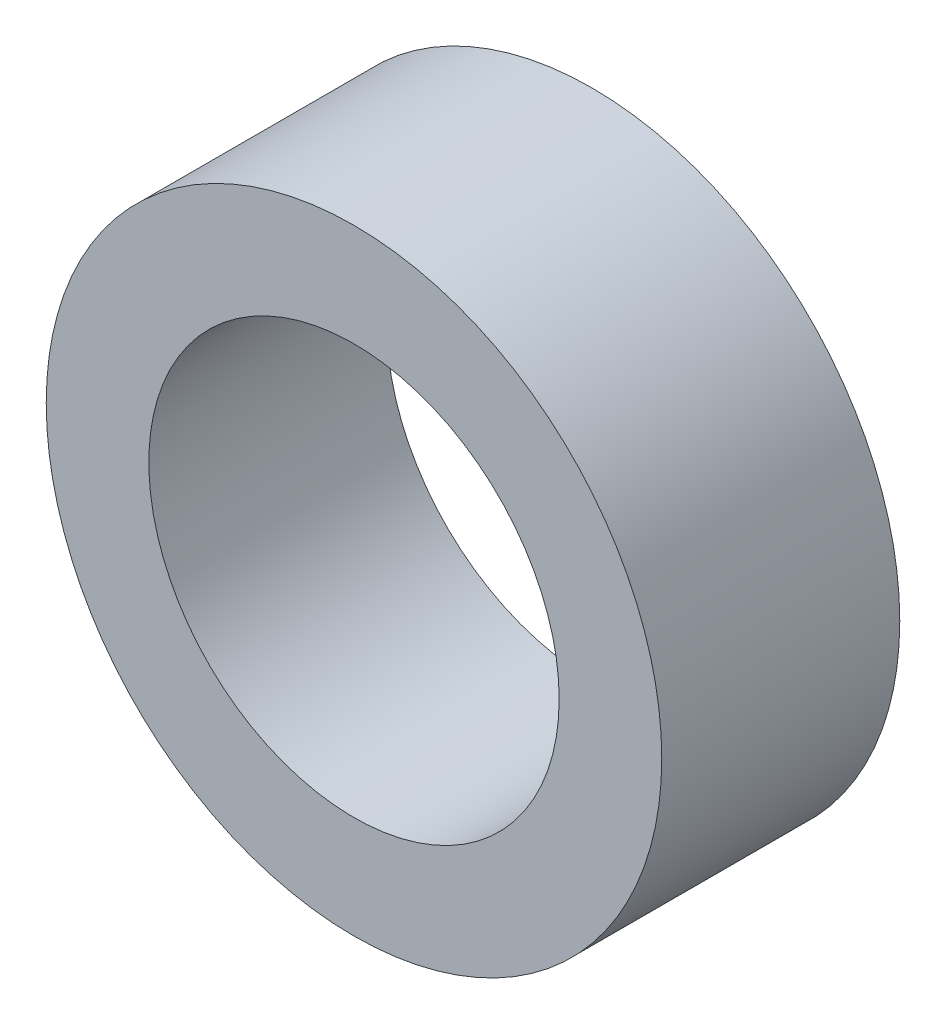
ISO-10303-21;
HEADER;
FILE_DESCRIPTION(('STEP AP214'),'2;1');
FILE_NAME('part.step','',(''),(''),'','','');
FILE_SCHEMA(('AUTOMOTIVE_DESIGN { 1 0 10303 214 1 1 1 1 }'));
ENDSEC;
DATA;
#1=APPLICATION_CONTEXT('core data for automotive mechanical design processes');
#2=APPLICATION_PROTOCOL_DEFINITION('international standard','automotive_design',2000,#1);
#3=PRODUCT_CONTEXT('',#1,'mechanical');
#4=PRODUCT('Part','Part','',(#3));
#5=PRODUCT_RELATED_PRODUCT_CATEGORY('part','',(#4));
#6=PRODUCT_DEFINITION_FORMATION('','',#4);
#7=PRODUCT_DEFINITION_CONTEXT('part definition',#1,'design');
#8=PRODUCT_DEFINITION('design','',#6,#7);
#9=PRODUCT_DEFINITION_SHAPE('','',#8);
#10=(LENGTH_UNIT() NAMED_UNIT(*) SI_UNIT(.MILLI.,.METRE.));
#11=(NAMED_UNIT(*) PLANE_ANGLE_UNIT() SI_UNIT($,.RADIAN.));
#12=(NAMED_UNIT(*) SI_UNIT($,.STERADIAN.) SOLID_ANGLE_UNIT());
#13=UNCERTAINTY_MEASURE_WITH_UNIT(LENGTH_MEASURE(1.E-05),#10,'distance_accuracy_value','');
#14=(GEOMETRIC_REPRESENTATION_CONTEXT(3) GLOBAL_UNCERTAINTY_ASSIGNED_CONTEXT((#13)) GLOBAL_UNIT_ASSIGNED_CONTEXT((#10,
#11,#12)) REPRESENTATION_CONTEXT('',''));
#15=CARTESIAN_POINT('',(0.,0.,0.));
#16=DIRECTION('',(0.,0.,1.));
#17=DIRECTION('',(1.,0.,0.));
#18=AXIS2_PLACEMENT_3D('',#15,#16,#17);
#19=CARTESIAN_POINT('',(0.,0.,7.366));
#20=DIRECTION('',(0.,0.,1.));
#21=DIRECTION('',(1.,0.,0.));
#22=AXIS2_PLACEMENT_3D('',#19,#20,#21);
#23=PLANE('',#22);
#24=CARTESIAN_POINT('',(0.,0.,7.366));
#25=DIRECTION('',(0.,0.,1.));
#26=DIRECTION('',(1.,0.,0.));
#27=AXIS2_PLACEMENT_3D('',#24,#25,#26);
#28=CIRCLE('',#27,9.525);
#29=CARTESIAN_POINT('',(9.525,0.,7.366));
#30=VERTEX_POINT('',#29);
#31=EDGE_CURVE('E10',#30,#30,#28,.T.);
#32=ORIENTED_EDGE('',*,*,#31,.T.);
#33=EDGE_LOOP('',(#32));
#34=FACE_BOUND('',#33,.T.);
#35=CARTESIAN_POINT('',(0.,0.,7.366));
#36=DIRECTION('',(0.,0.,1.));
#37=DIRECTION('',(1.,0.,0.));
#38=AXIS2_PLACEMENT_3D('',#35,#36,#37);
#39=CIRCLE('',#38,6.35);
#40=CARTESIAN_POINT('',(6.35,0.,7.366));
#41=VERTEX_POINT('',#40);
#42=EDGE_CURVE('E43',#41,#41,#39,.T.);
#43=ORIENTED_EDGE('',*,*,#42,.F.);
#44=EDGE_LOOP('',(#43));
#45=FACE_BOUND('',#44,.T.);
#46=ADVANCED_FACE('F32',(#34,#45),#23,.T.);
#47=CARTESIAN_POINT('',(0.,0.,0.));
#48=DIRECTION('',(0.,0.,1.));
#49=DIRECTION('',(1.,0.,0.));
#50=AXIS2_PLACEMENT_3D('',#47,#48,#49);
#51=PLANE('',#50);
#52=CARTESIAN_POINT('',(0.,0.,0.));
#53=DIRECTION('',(0.,0.,1.));
#54=DIRECTION('',(1.,0.,0.));
#55=AXIS2_PLACEMENT_3D('',#52,#53,#54);
#56=CIRCLE('',#55,9.525);
#57=CARTESIAN_POINT('',(9.525,0.,0.));
#58=VERTEX_POINT('',#57);
#59=EDGE_CURVE('E36',#58,#58,#56,.T.);
#60=ORIENTED_EDGE('',*,*,#59,.F.);
#61=EDGE_LOOP('',(#60));
#62=FACE_BOUND('',#61,.T.);
#63=CARTESIAN_POINT('',(0.,0.,0.));
#64=DIRECTION('',(0.,0.,1.));
#65=DIRECTION('',(1.,0.,0.));
#66=AXIS2_PLACEMENT_3D('',#63,#64,#65);
#67=CIRCLE('',#66,6.35);
#68=CARTESIAN_POINT('',(6.35,0.,0.));
#69=VERTEX_POINT('',#68);
#70=EDGE_CURVE('E45',#69,#69,#67,.T.);
#71=ORIENTED_EDGE('',*,*,#70,.T.);
#72=EDGE_LOOP('',(#71));
#73=FACE_BOUND('',#72,.T.);
#74=ADVANCED_FACE('F55',(#62,#73),#51,.F.);
#75=CARTESIAN_POINT('',(0.,0.,7.366));
#76=DIRECTION('',(0.,0.,-1.));
#77=DIRECTION('',(-1.,0.,0.));
#78=AXIS2_PLACEMENT_3D('',#75,#76,#77);
#79=CYLINDRICAL_SURFACE('',#78,9.525);
#80=ORIENTED_EDGE('',*,*,#31,.F.);
#81=EDGE_LOOP('',(#80));
#82=FACE_BOUND('',#81,.T.);
#83=ORIENTED_EDGE('',*,*,#59,.T.);
#84=EDGE_LOOP('',(#83));
#85=FACE_BOUND('',#84,.T.);
#86=ADVANCED_FACE('F34',(#82,#85),#79,.T.);
#87=CARTESIAN_POINT('',(0.,0.,7.366));
#88=DIRECTION('',(0.,0.,-1.));
#89=DIRECTION('',(-1.,0.,0.));
#90=AXIS2_PLACEMENT_3D('',#87,#88,#89);
#91=CYLINDRICAL_SURFACE('',#90,6.35);
#92=ORIENTED_EDGE('',*,*,#42,.T.);
#93=EDGE_LOOP('',(#92));
#94=FACE_BOUND('',#93,.T.);
#95=ORIENTED_EDGE('',*,*,#70,.F.);
#96=EDGE_LOOP('',(#95));
#97=FACE_BOUND('',#96,.T.);
#98=ADVANCED_FACE('F51',(#94,#97),#91,.F.);
#99=CLOSED_SHELL('',(#46,#74,#86,#98));
#100=MANIFOLD_SOLID_BREP('B2',#99);
#101=ADVANCED_BREP_SHAPE_REPRESENTATION('',(#18,#100),#14);
#102=SHAPE_DEFINITION_REPRESENTATION(#9,#101);
ENDSEC;
END-ISO-10303-21;
